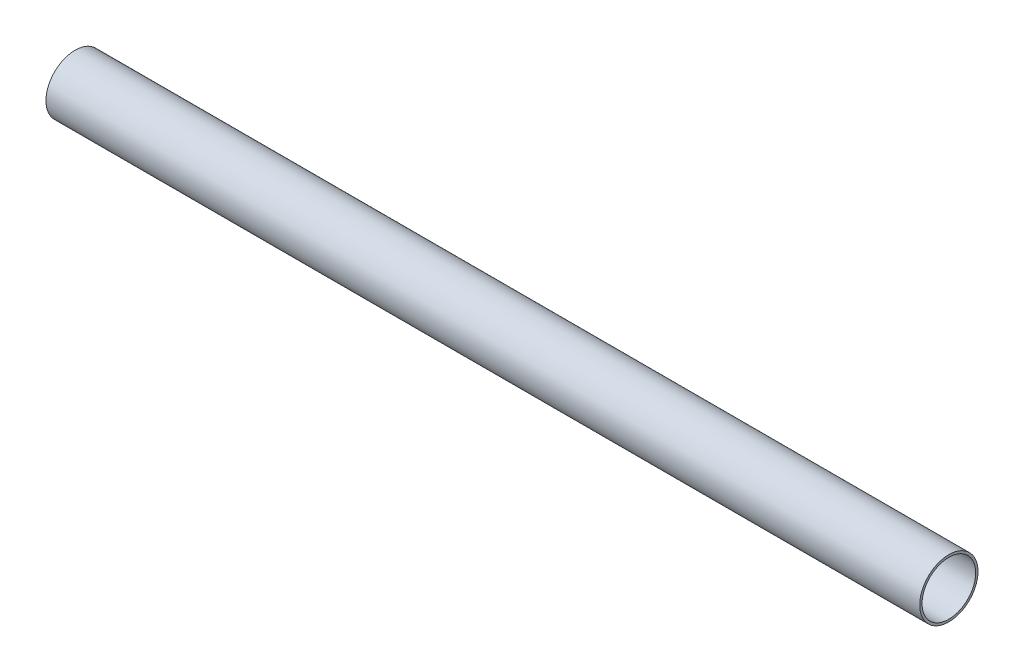
ISO-10303-21;
HEADER;
FILE_DESCRIPTION(('STEP AP214'),'2;1');
FILE_NAME('part.step','',(''),(''),'','','');
FILE_SCHEMA(('AUTOMOTIVE_DESIGN { 1 0 10303 214 1 1 1 1 }'));
ENDSEC;
DATA;
#1=APPLICATION_CONTEXT('core data for automotive mechanical design processes');
#2=APPLICATION_PROTOCOL_DEFINITION('international standard','automotive_design',2000,#1);
#3=PRODUCT_CONTEXT('',#1,'mechanical');
#4=PRODUCT('Part','Part','',(#3));
#5=PRODUCT_RELATED_PRODUCT_CATEGORY('part','',(#4));
#6=PRODUCT_DEFINITION_FORMATION('','',#4);
#7=PRODUCT_DEFINITION_CONTEXT('part definition',#1,'design');
#8=PRODUCT_DEFINITION('design','',#6,#7);
#9=PRODUCT_DEFINITION_SHAPE('','',#8);
#10=(LENGTH_UNIT() NAMED_UNIT(*) SI_UNIT(.MILLI.,.METRE.));
#11=(NAMED_UNIT(*) PLANE_ANGLE_UNIT() SI_UNIT($,.RADIAN.));
#12=(NAMED_UNIT(*) SI_UNIT($,.STERADIAN.) SOLID_ANGLE_UNIT());
#13=UNCERTAINTY_MEASURE_WITH_UNIT(LENGTH_MEASURE(1.E-05),#10,'distance_accuracy_value','');
#14=(GEOMETRIC_REPRESENTATION_CONTEXT(3) GLOBAL_UNCERTAINTY_ASSIGNED_CONTEXT((#13)) GLOBAL_UNIT_ASSIGNED_CONTEXT((#10,
#11,#12)) REPRESENTATION_CONTEXT('',''));
#15=CARTESIAN_POINT('',(0.,0.,0.));
#16=DIRECTION('',(0.,0.,1.));
#17=DIRECTION('',(1.,0.,0.));
#18=AXIS2_PLACEMENT_3D('',#15,#16,#17);
#19=CARTESIAN_POINT('',(749.3,0.,0.));
#20=DIRECTION('',(1.,0.,0.));
#21=DIRECTION('',(0.,0.,-1.));
#22=AXIS2_PLACEMENT_3D('',#19,#20,#21);
#23=PLANE('',#22);
#24=CARTESIAN_POINT('',(749.3,0.,0.));
#25=DIRECTION('',(1.,0.,0.));
#26=DIRECTION('',(0.,0.,-1.));
#27=AXIS2_PLACEMENT_3D('',#24,#25,#26);
#28=CIRCLE('',#27,25.);
#29=CARTESIAN_POINT('',(749.3,0.,-25.));
#30=VERTEX_POINT('',#29);
#31=EDGE_CURVE('E10',#30,#30,#28,.T.);
#32=ORIENTED_EDGE('',*,*,#31,.T.);
#33=EDGE_LOOP('',(#32));
#34=FACE_BOUND('',#33,.T.);
#35=CARTESIAN_POINT('',(749.3,0.,0.));
#36=DIRECTION('',(1.,0.,0.));
#37=DIRECTION('',(0.,0.,-1.));
#38=AXIS2_PLACEMENT_3D('',#35,#36,#37);
#39=CIRCLE('',#38,23.);
#40=CARTESIAN_POINT('',(749.3,0.,-23.));
#41=VERTEX_POINT('',#40);
#42=EDGE_CURVE('E54',#41,#41,#39,.T.);
#43=ORIENTED_EDGE('',*,*,#42,.F.);
#44=EDGE_LOOP('',(#43));
#45=FACE_BOUND('',#44,.T.);
#46=ADVANCED_FACE('F41',(#34,#45),#23,.T.);
#47=CARTESIAN_POINT('',(0.,0.,0.));
#48=DIRECTION('',(1.,0.,0.));
#49=DIRECTION('',(0.,0.,-1.));
#50=AXIS2_PLACEMENT_3D('',#47,#48,#49);
#51=PLANE('',#50);
#52=CARTESIAN_POINT('',(0.,0.,0.));
#53=DIRECTION('',(1.,0.,0.));
#54=DIRECTION('',(0.,0.,-1.));
#55=AXIS2_PLACEMENT_3D('',#52,#53,#54);
#56=CIRCLE('',#55,25.);
#57=CARTESIAN_POINT('',(0.,0.,-25.));
#58=VERTEX_POINT('',#57);
#59=EDGE_CURVE('E45',#58,#58,#56,.T.);
#60=ORIENTED_EDGE('',*,*,#59,.F.);
#61=EDGE_LOOP('',(#60));
#62=FACE_BOUND('',#61,.T.);
#63=CARTESIAN_POINT('',(0.,0.,0.));
#64=DIRECTION('',(1.,0.,0.));
#65=DIRECTION('',(0.,0.,-1.));
#66=AXIS2_PLACEMENT_3D('',#63,#64,#65);
#67=CIRCLE('',#66,23.);
#68=CARTESIAN_POINT('',(0.,0.,-23.));
#69=VERTEX_POINT('',#68);
#70=EDGE_CURVE('E56',#69,#69,#67,.T.);
#71=ORIENTED_EDGE('',*,*,#70,.T.);
#72=EDGE_LOOP('',(#71));
#73=FACE_BOUND('',#72,.T.);
#74=ADVANCED_FACE('F68',(#62,#73),#51,.F.);
#75=CARTESIAN_POINT('',(749.3,0.,0.));
#76=DIRECTION('',(-1.,0.,0.));
#77=DIRECTION('',(0.,0.,1.));
#78=AXIS2_PLACEMENT_3D('',#75,#76,#77);
#79=CYLINDRICAL_SURFACE('',#78,25.);
#80=ORIENTED_EDGE('',*,*,#31,.F.);
#81=EDGE_LOOP('',(#80));
#82=FACE_BOUND('',#81,.T.);
#83=ORIENTED_EDGE('',*,*,#59,.T.);
#84=EDGE_LOOP('',(#83));
#85=FACE_BOUND('',#84,.T.);
#86=ADVANCED_FACE('F43',(#82,#85),#79,.T.);
#87=CARTESIAN_POINT('',(749.3,0.,0.));
#88=DIRECTION('',(-1.,0.,0.));
#89=DIRECTION('',(0.,0.,1.));
#90=AXIS2_PLACEMENT_3D('',#87,#88,#89);
#91=CYLINDRICAL_SURFACE('',#90,23.);
#92=ORIENTED_EDGE('',*,*,#42,.T.);
#93=EDGE_LOOP('',(#92));
#94=FACE_BOUND('',#93,.T.);
#95=ORIENTED_EDGE('',*,*,#70,.F.);
#96=EDGE_LOOP('',(#95));
#97=FACE_BOUND('',#96,.T.);
#98=ADVANCED_FACE('F64',(#94,#97),#91,.F.);
#99=CLOSED_SHELL('',(#46,#74,#86,#98));
#100=MANIFOLD_SOLID_BREP('B2',#99);
#101=ADVANCED_BREP_SHAPE_REPRESENTATION('',(#18,#100),#14);
#102=SHAPE_DEFINITION_REPRESENTATION(#9,#101);
ENDSEC;
END-ISO-10303-21;
